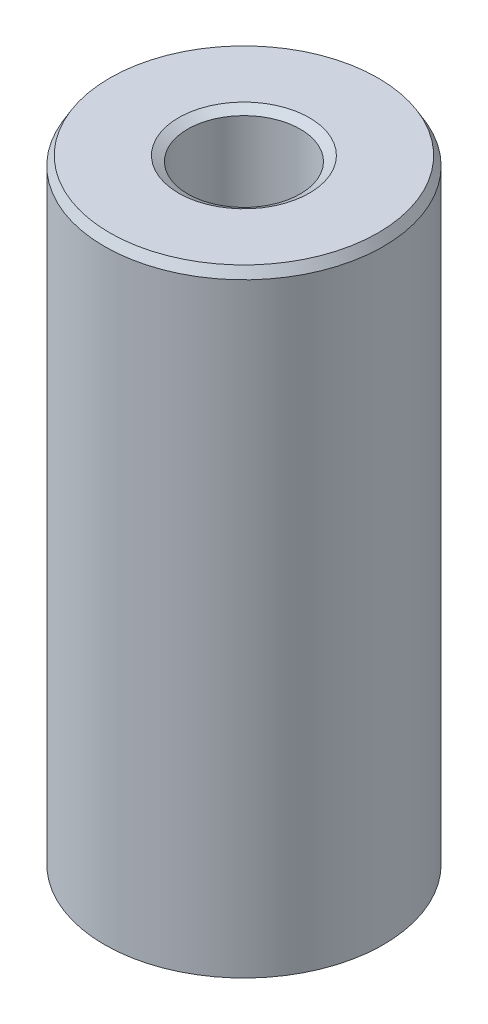
ISO-10303-21;
HEADER;
FILE_DESCRIPTION(('STEP AP214'),'2;1');
FILE_NAME('part.step','',(''),(''),'','','');
FILE_SCHEMA(('AUTOMOTIVE_DESIGN { 1 0 10303 214 1 1 1 1 }'));
ENDSEC;
DATA;
#1=APPLICATION_CONTEXT('core data for automotive mechanical design processes');
#2=APPLICATION_PROTOCOL_DEFINITION('international standard','automotive_design',2000,#1);
#3=PRODUCT_CONTEXT('',#1,'mechanical');
#4=PRODUCT('Part','Part','',(#3));
#5=PRODUCT_RELATED_PRODUCT_CATEGORY('part','',(#4));
#6=PRODUCT_DEFINITION_FORMATION('','',#4);
#7=PRODUCT_DEFINITION_CONTEXT('part definition',#1,'design');
#8=PRODUCT_DEFINITION('design','',#6,#7);
#9=PRODUCT_DEFINITION_SHAPE('','',#8);
#10=(LENGTH_UNIT() NAMED_UNIT(*) SI_UNIT(.MILLI.,.METRE.));
#11=(NAMED_UNIT(*) PLANE_ANGLE_UNIT() SI_UNIT($,.RADIAN.));
#12=(NAMED_UNIT(*) SI_UNIT($,.STERADIAN.) SOLID_ANGLE_UNIT());
#13=UNCERTAINTY_MEASURE_WITH_UNIT(LENGTH_MEASURE(1.E-05),#10,'distance_accuracy_value','');
#14=(GEOMETRIC_REPRESENTATION_CONTEXT(3) GLOBAL_UNCERTAINTY_ASSIGNED_CONTEXT((#13)) GLOBAL_UNIT_ASSIGNED_CONTEXT((#10,
#11,#12)) REPRESENTATION_CONTEXT('',''));
#15=CARTESIAN_POINT('',(0.,0.,0.));
#16=DIRECTION('',(0.,0.,1.));
#17=DIRECTION('',(1.,0.,0.));
#18=AXIS2_PLACEMENT_3D('',#15,#16,#17);
#19=CARTESIAN_POINT('',(0.,55.4995890550862,0.));
#20=DIRECTION('',(0.,-1.,0.));
#21=DIRECTION('',(0.,0.,-1.));
#22=AXIS2_PLACEMENT_3D('',#19,#20,#21);
#23=CYLINDRICAL_SURFACE('',#22,12.5);
#24=CARTESIAN_POINT('',(0.,0.473484841791397,0.));
#25=DIRECTION('',(0.,1.,0.));
#26=DIRECTION('',(0.,0.,1.));
#27=AXIS2_PLACEMENT_3D('',#24,#25,#26);
#28=CIRCLE('',#27,12.5);
#29=CARTESIAN_POINT('',(0.,0.473484841791397,12.5));
#30=VERTEX_POINT('',#29);
#31=EDGE_CURVE('E10',#30,#30,#28,.T.);
#32=ORIENTED_EDGE('',*,*,#31,.T.);
#33=EDGE_LOOP('',(#32));
#34=FACE_BOUND('',#33,.T.);
#35=CARTESIAN_POINT('',(0.,54.6794892524897,0.));
#36=DIRECTION('',(0.,1.,0.));
#37=DIRECTION('',(0.,0.,1.));
#38=AXIS2_PLACEMENT_3D('',#35,#36,#37);
#39=CIRCLE('',#38,12.5);
#40=CARTESIAN_POINT('',(0.,54.6794892524897,12.5));
#41=VERTEX_POINT('',#40);
#42=EDGE_CURVE('E50',#41,#41,#39,.F.);
#43=ORIENTED_EDGE('',*,*,#42,.T.);
#44=EDGE_LOOP('',(#43));
#45=FACE_BOUND('',#44,.T.);
#46=ADVANCED_FACE('F39',(#34,#45),#23,.T.);
#47=CARTESIAN_POINT('',(0.,55.4995890550862,0.));
#48=DIRECTION('',(0.,1.,0.));
#49=DIRECTION('',(0.,0.,1.));
#50=AXIS2_PLACEMENT_3D('',#47,#48,#49);
#51=PLANE('',#50);
#52=CARTESIAN_POINT('',(0.,55.4995890550862,0.));
#53=DIRECTION('',(0.,1.,0.));
#54=DIRECTION('',(0.,0.,1.));
#55=AXIS2_PLACEMENT_3D('',#52,#53,#54);
#56=CIRCLE('',#55,5.8628976884208);
#57=CARTESIAN_POINT('',(0.,55.4995890550862,5.8628976884208));
#58=VERTEX_POINT('',#57);
#59=EDGE_CURVE('E58',#58,#58,#56,.F.);
#60=ORIENTED_EDGE('',*,*,#59,.T.);
#61=EDGE_LOOP('',(#60));
#62=FACE_BOUND('',#61,.T.);
#63=CARTESIAN_POINT('',(0.,55.4995890550862,0.));
#64=DIRECTION('',(0.,1.,0.));
#65=DIRECTION('',(0.,0.,1.));
#66=AXIS2_PLACEMENT_3D('',#63,#64,#65);
#67=CIRCLE('',#66,12.0265151582086);
#68=CARTESIAN_POINT('',(0.,55.4995890550862,12.0265151582086));
#69=VERTEX_POINT('',#68);
#70=EDGE_CURVE('E61',#69,#69,#67,.T.);
#71=ORIENTED_EDGE('',*,*,#70,.T.);
#72=EDGE_LOOP('',(#71));
#73=FACE_BOUND('',#72,.T.);
#74=ADVANCED_FACE('F88',(#62,#73),#51,.T.);
#75=CARTESIAN_POINT('',(0.,0.,0.));
#76=DIRECTION('',(0.,1.,0.));
#77=DIRECTION('',(0.,0.,1.));
#78=AXIS2_PLACEMENT_3D('',#75,#76,#77);
#79=PLANE('',#78);
#80=CARTESIAN_POINT('',(0.,0.,0.));
#81=DIRECTION('',(0.,1.,0.));
#82=DIRECTION('',(0.,0.,1.));
#83=AXIS2_PLACEMENT_3D('',#80,#81,#82);
#84=CIRCLE('',#83,5.51628272761577);
#85=CARTESIAN_POINT('',(0.,0.,5.51628272761577));
#86=VERTEX_POINT('',#85);
#87=EDGE_CURVE('E51',#86,#86,#84,.T.);
#88=ORIENTED_EDGE('',*,*,#87,.T.);
#89=EDGE_LOOP('',(#88));
#90=FACE_BOUND('',#89,.T.);
#91=CARTESIAN_POINT('',(0.,0.,0.));
#92=DIRECTION('',(0.,1.,0.));
#93=DIRECTION('',(0.,0.,1.));
#94=AXIS2_PLACEMENT_3D('',#91,#92,#93);
#95=CIRCLE('',#94,11.6799001974036);
#96=CARTESIAN_POINT('',(0.,0.,11.6799001974036));
#97=VERTEX_POINT('',#96);
#98=EDGE_CURVE('E54',#97,#97,#95,.F.);
#99=ORIENTED_EDGE('',*,*,#98,.T.);
#100=EDGE_LOOP('',(#99));
#101=FACE_BOUND('',#100,.T.);
#102=ADVANCED_FACE('F83',(#90,#101),#79,.F.);
#103=CARTESIAN_POINT('',(0.,55.4995890550862,0.));
#104=DIRECTION('',(0.,-1.,0.));
#105=DIRECTION('',(0.,0.,-1.));
#106=AXIS2_PLACEMENT_3D('',#103,#104,#105);
#107=CYLINDRICAL_SURFACE('',#106,5.04279788582437);
#108=CARTESIAN_POINT('',(0.,55.0261042132948,0.));
#109=DIRECTION('',(0.,1.,0.));
#110=DIRECTION('',(0.,0.,1.));
#111=AXIS2_PLACEMENT_3D('',#108,#109,#110);
#112=CIRCLE('',#111,5.04279788582437);
#113=CARTESIAN_POINT('',(0.,55.0261042132948,5.04279788582437));
#114=VERTEX_POINT('',#113);
#115=EDGE_CURVE('E67',#114,#114,#112,.T.);
#116=ORIENTED_EDGE('',*,*,#115,.T.);
#117=EDGE_LOOP('',(#116));
#118=FACE_BOUND('',#117,.T.);
#119=CARTESIAN_POINT('',(0.,0.820099802596411,0.));
#120=DIRECTION('',(0.,1.,0.));
#121=DIRECTION('',(0.,0.,1.));
#122=AXIS2_PLACEMENT_3D('',#119,#120,#121);
#123=CIRCLE('',#122,5.04279788582437);
#124=CARTESIAN_POINT('',(0.,0.820099802596411,5.04279788582437));
#125=VERTEX_POINT('',#124);
#126=EDGE_CURVE('E69',#125,#125,#123,.F.);
#127=ORIENTED_EDGE('',*,*,#126,.T.);
#128=EDGE_LOOP('',(#127));
#129=FACE_BOUND('',#128,.T.);
#130=ADVANCED_FACE('F71',(#118,#129),#107,.F.);
#131=CARTESIAN_POINT('',(0.,55.0261042132948,0.));
#132=DIRECTION('',(0.,1.,0.));
#133=DIRECTION('',(0.,0.,1.));
#134=AXIS2_PLACEMENT_3D('',#131,#132,#133);
#135=CONICAL_SURFACE('',#134,5.04279788582437,1.0471975511966);
#136=ORIENTED_EDGE('',*,*,#59,.F.);
#137=EDGE_LOOP('',(#136));
#138=FACE_BOUND('',#137,.T.);
#139=ORIENTED_EDGE('',*,*,#115,.F.);
#140=EDGE_LOOP('',(#139));
#141=FACE_BOUND('',#140,.T.);
#142=ADVANCED_FACE('F77',(#138,#141),#135,.F.);
#143=CARTESIAN_POINT('',(0.,0.,0.));
#144=DIRECTION('',(0.,-1.,0.));
#145=DIRECTION('',(0.,0.,-1.));
#146=AXIS2_PLACEMENT_3D('',#143,#144,#145);
#147=CONICAL_SURFACE('',#146,5.51628272761577,0.5235987755983);
#148=ORIENTED_EDGE('',*,*,#126,.F.);
#149=EDGE_LOOP('',(#148));
#150=FACE_BOUND('',#149,.T.);
#151=ORIENTED_EDGE('',*,*,#87,.F.);
#152=EDGE_LOOP('',(#151));
#153=FACE_BOUND('',#152,.T.);
#154=ADVANCED_FACE('F73',(#150,#153),#147,.F.);
#155=CARTESIAN_POINT('',(0.,0.473484841791397,0.));
#156=DIRECTION('',(0.,1.,0.));
#157=DIRECTION('',(0.,0.,1.));
#158=AXIS2_PLACEMENT_3D('',#155,#156,#157);
#159=CONICAL_SURFACE('',#158,12.5,1.0471975511966);
#160=CARTESIAN_POINT('',(0.,0.,11.6799001974036));
#161=CARTESIAN_POINT('',(0.,0.0049321337686607,11.6884429036806));
#162=CARTESIAN_POINT('',(0.,0.00986426753732096,11.6969856099577));
#163=CARTESIAN_POINT('',(0.,0.0197285350746415,11.7140710225118));
#164=CARTESIAN_POINT('',(0.,0.0246606688433017,11.7226137287888));
#165=CARTESIAN_POINT('',(0.,0.0345249363806225,11.7396991413429));
#166=CARTESIAN_POINT('',(0.,0.039457070149283,11.74824184762));
#167=CARTESIAN_POINT('',(0.,0.0493213376866038,11.765327260174));
#168=CARTESIAN_POINT('',(0.,0.0542534714552641,11.7738699664511));
#169=CARTESIAN_POINT('',(0.,0.064117738992585,11.7909553790052));
#170=CARTESIAN_POINT('',(0.,0.0690498727612455,11.7994980852822));
#171=CARTESIAN_POINT('',(0.,0.0789141402985662,11.8165834978363));
#172=CARTESIAN_POINT('',(0.,0.0838462740672264,11.8251262041134));
#173=CARTESIAN_POINT('',(0.,0.093710541604547,11.8422116166675));
#174=CARTESIAN_POINT('',(0.,0.0986426753732075,11.8507543229445));
#175=CARTESIAN_POINT('',(0.,0.108506942910528,11.8678397354986));
#176=CARTESIAN_POINT('',(0.,0.113439076679189,11.8763824417756));
#177=CARTESIAN_POINT('',(0.,0.12330334421651,11.8934678543297));
#178=CARTESIAN_POINT('',(0.,0.12823547798517,11.9020105606068));
#179=CARTESIAN_POINT('',(0.,0.13809974552249,11.9190959731609));
#180=CARTESIAN_POINT('',(0.,0.143031879291151,11.9276386794379));
#181=CARTESIAN_POINT('',(0.,0.152896146828472,11.944724091992));
#182=CARTESIAN_POINT('',(0.,0.157828280597132,11.9532667982691));
#183=CARTESIAN_POINT('',(0.,0.167692548134453,11.9703522108231));
#184=CARTESIAN_POINT('',(0.,0.172624681903113,11.9788949171002));
#185=CARTESIAN_POINT('',(0.,0.182488949440434,11.9959803296543));
#186=CARTESIAN_POINT('',(0.,0.187421083209094,12.0045230359313));
#187=CARTESIAN_POINT('',(0.,0.197285350746415,12.0216084484854));
#188=CARTESIAN_POINT('',(0.,0.202217484515076,12.0301511547625));
#189=CARTESIAN_POINT('',(0.,0.212081752052397,12.0472365673166));
#190=CARTESIAN_POINT('',(0.,0.217013885821057,12.0557792735936));
#191=CARTESIAN_POINT('',(0.,0.226878153358377,12.0728646861477));
#192=CARTESIAN_POINT('',(0.,0.231810287127038,12.0814073924247));
#193=CARTESIAN_POINT('',(0.,0.241674554664359,12.0984928049788));
#194=CARTESIAN_POINT('',(0.,0.246606688433019,12.1070355112559));
#195=CARTESIAN_POINT('',(0.,0.25647095597034,12.12412092381));
#196=CARTESIAN_POINT('',(0.,0.261403089739,12.132663630087));
#197=CARTESIAN_POINT('',(0.,0.271267357276321,12.1497490426411));
#198=CARTESIAN_POINT('',(0.,0.276199491044981,12.1582917489182));
#199=CARTESIAN_POINT('',(0.,0.286063758582302,12.1753771614723));
#200=CARTESIAN_POINT('',(0.,0.290995892350963,12.1839198677493));
#201=CARTESIAN_POINT('',(0.,0.300860159888283,12.2010052803034));
#202=CARTESIAN_POINT('',(0.,0.305792293656944,12.2095479865804));
#203=CARTESIAN_POINT('',(0.,0.315656561194264,12.2266333991345));
#204=CARTESIAN_POINT('',(0.,0.320588694962925,12.2351761054116));
#205=CARTESIAN_POINT('',(0.,0.330452962500246,12.2522615179657));
#206=CARTESIAN_POINT('',(0.,0.335385096268906,12.2608042242427));
#207=CARTESIAN_POINT('',(0.,0.345249363806227,12.2778896367968));
#208=CARTESIAN_POINT('',(0.,0.350181497574887,12.2864323430739));
#209=CARTESIAN_POINT('',(0.,0.360045765112208,12.3035177556279));
#210=CARTESIAN_POINT('',(0.,0.364977898880868,12.312060461905));
#211=CARTESIAN_POINT('',(0.,0.374842166418189,12.3291458744591));
#212=CARTESIAN_POINT('',(0.,0.379774300186849,12.3376885807361));
#213=CARTESIAN_POINT('',(0.,0.38963856772417,12.3547739932902));
#214=CARTESIAN_POINT('',(0.,0.394570701492831,12.3633166995673));
#215=CARTESIAN_POINT('',(0.,0.404434969030151,12.3804021121214));
#216=CARTESIAN_POINT('',(0.,0.409367102798812,12.3889448183984));
#217=CARTESIAN_POINT('',(0.,0.419231370336132,12.4060302309525));
#218=CARTESIAN_POINT('',(0.,0.424163504104793,12.4145729372295));
#219=CARTESIAN_POINT('',(0.,0.434027771642114,12.4316583497836));
#220=CARTESIAN_POINT('',(0.,0.438959905410774,12.4402010560607));
#221=CARTESIAN_POINT('',(0.,0.448824172948095,12.4572864686148));
#222=CARTESIAN_POINT('',(0.,0.453756306716755,12.4658291748918));
#223=CARTESIAN_POINT('',(0.,0.463620574254076,12.4829145874459));
#224=CARTESIAN_POINT('',(0.,0.468552708022736,12.491457293723));
#225=CARTESIAN_POINT('',(0.,0.473484841791397,12.5));
#226=B_SPLINE_CURVE_WITH_KNOTS('',3,(#160,#161,#162,#163,#164,#165,#166,#167,#168,#169,#170,
#171,#172,#173,#174,#175,#176,#177,#178,#179,#180,#181,#182,#183,#184,#185,#186,#187,#188,#189,
#190,#191,#192,#193,#194,#195,#196,#197,#198,#199,#200,#201,#202,#203,#204,#205,#206,#207,#208,
#209,#210,#211,#212,#213,#214,#215,#216,#217,#218,#219,#220,#221,#222,#223,#224,#225),
.UNSPECIFIED.,.F.,.F.,(4,2,2,2,2,2,2,2,2,2,2,2,2,2,2,2,2,2,2,2,2,2,2,2,2,2,2,2,2,2,2,2,4),(0.,
0.0295928026119619,0.0591856052239253,0.0887784078358873,0.118371210447849,0.147964013059811,
0.177556815671775,0.207149618283736,0.236742420895698,0.266335223507662,0.295928026119624,
0.325520828731586,0.355113631343549,0.384706433955511,0.414299236567473,0.443892039179436,
0.473484841791398,0.50307764440336,0.532670447015324,0.562263249627286,0.591856052239247,
0.621448854851211,0.651041657463173,0.680634460075135,0.710227262687098,0.73982006529906,
0.769412867911022,0.799005670522983,0.828598473134947,0.858191275746909,0.887784078358871,
0.917376880970834,0.946969683582796),.UNSPECIFIED.);
#227=EDGE_CURVE('BSEAM76',#97,#30,#226,.T.);
#228=ORIENTED_EDGE('',*,*,#98,.F.);
#229=ORIENTED_EDGE('',*,*,#31,.F.);
#230=ORIENTED_EDGE('',*,*,#227,.T.);
#231=ORIENTED_EDGE('',*,*,#227,.F.);
#232=EDGE_LOOP('',(#228,#230,#229,#231));
#233=FACE_BOUND('',#232,.T.);
#234=ADVANCED_FACE('F76',(#233),#159,.T.);
#235=CARTESIAN_POINT('',(0.,55.4995890550862,0.));
#236=DIRECTION('',(0.,-1.,0.));
#237=DIRECTION('',(0.,0.,-1.));
#238=AXIS2_PLACEMENT_3D('',#235,#236,#237);
#239=CONICAL_SURFACE('',#238,12.0265151582086,0.52359877559829);
#240=ORIENTED_EDGE('',*,*,#42,.F.);
#241=EDGE_LOOP('',(#240));
#242=FACE_BOUND('',#241,.T.);
#243=ORIENTED_EDGE('',*,*,#70,.F.);
#244=EDGE_LOOP('',(#243));
#245=FACE_BOUND('',#244,.T.);
#246=ADVANCED_FACE('F45',(#242,#245),#239,.T.);
#247=CLOSED_SHELL('',(#46,#74,#102,#130,#142,#154,#234,#246));
#248=MANIFOLD_SOLID_BREP('B2',#247);
#249=ADVANCED_BREP_SHAPE_REPRESENTATION('',(#18,#248),#14);
#250=SHAPE_DEFINITION_REPRESENTATION(#9,#249);
ENDSEC;
END-ISO-10303-21;
